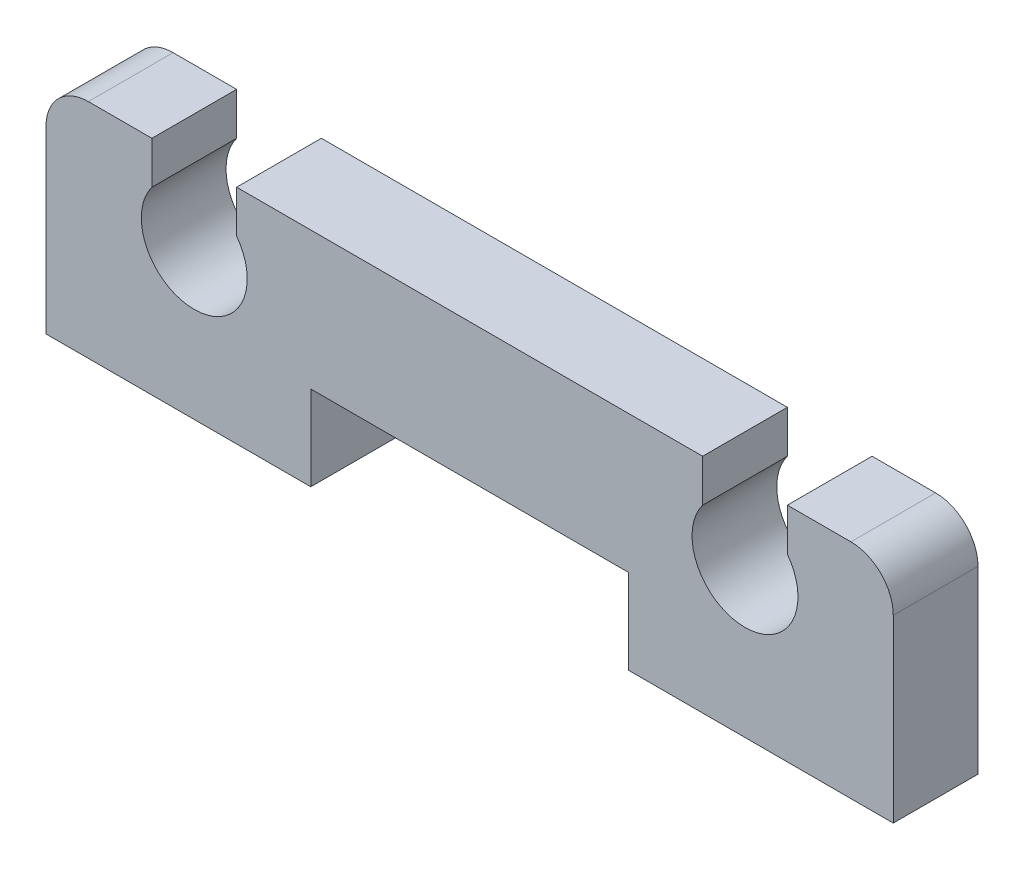
ISO-10303-21;
HEADER;
FILE_DESCRIPTION(('STEP AP214'),'2;1');
FILE_NAME('part.step','',(''),(''),'','','');
FILE_SCHEMA(('AUTOMOTIVE_DESIGN { 1 0 10303 214 1 1 1 1 }'));
ENDSEC;
DATA;
#1=APPLICATION_CONTEXT('core data for automotive mechanical design processes');
#2=APPLICATION_PROTOCOL_DEFINITION('international standard','automotive_design',2000,#1);
#3=PRODUCT_CONTEXT('',#1,'mechanical');
#4=PRODUCT('Part','Part','',(#3));
#5=PRODUCT_RELATED_PRODUCT_CATEGORY('part','',(#4));
#6=PRODUCT_DEFINITION_FORMATION('','',#4);
#7=PRODUCT_DEFINITION_CONTEXT('part definition',#1,'design');
#8=PRODUCT_DEFINITION('design','',#6,#7);
#9=PRODUCT_DEFINITION_SHAPE('','',#8);
#10=(LENGTH_UNIT() NAMED_UNIT(*) SI_UNIT(.MILLI.,.METRE.));
#11=(NAMED_UNIT(*) PLANE_ANGLE_UNIT() SI_UNIT($,.RADIAN.));
#12=(NAMED_UNIT(*) SI_UNIT($,.STERADIAN.) SOLID_ANGLE_UNIT());
#13=UNCERTAINTY_MEASURE_WITH_UNIT(LENGTH_MEASURE(1.E-05),#10,'distance_accuracy_value','');
#14=(GEOMETRIC_REPRESENTATION_CONTEXT(3) GLOBAL_UNCERTAINTY_ASSIGNED_CONTEXT((#13)) GLOBAL_UNIT_ASSIGNED_CONTEXT((#10,
#11,#12)) REPRESENTATION_CONTEXT('',''));
#15=CARTESIAN_POINT('',(0.,0.,0.));
#16=DIRECTION('',(0.,0.,1.));
#17=DIRECTION('',(1.,0.,0.));
#18=AXIS2_PLACEMENT_3D('',#15,#16,#17);
#19=CARTESIAN_POINT('',(-10.,0.,2.));
#20=DIRECTION('',(0.,1.,0.));
#21=DIRECTION('',(0.,0.,1.));
#22=AXIS2_PLACEMENT_3D('',#19,#20,#21);
#23=PLANE('',#22);
#24=DIRECTION('',(1.,0.,0.));
#25=VECTOR('',#24,1.);
#26=CARTESIAN_POINT('',(-10.,0.,0.));
#27=LINE('',#26,#25);
#28=CARTESIAN_POINT('',(-10.,0.,0.));
#29=VERTEX_POINT('',#28);
#30=CARTESIAN_POINT('',(-3.75,0.,0.));
#31=VERTEX_POINT('',#30);
#32=EDGE_CURVE('E180',#29,#31,#27,.T.);
#33=ORIENTED_EDGE('',*,*,#32,.T.);
#34=DIRECTION('',(0.,0.,-1.));
#35=VECTOR('',#34,1.);
#36=CARTESIAN_POINT('',(-3.75,0.,2.));
#37=LINE('',#36,#35);
#38=CARTESIAN_POINT('',(-3.75,0.,2.));
#39=VERTEX_POINT('',#38);
#40=EDGE_CURVE('E162',#39,#31,#37,.T.);
#41=ORIENTED_EDGE('',*,*,#40,.F.);
#42=DIRECTION('',(1.,0.,0.));
#43=VECTOR('',#42,1.);
#44=CARTESIAN_POINT('',(-10.,0.,2.));
#45=LINE('',#44,#43);
#46=CARTESIAN_POINT('',(-10.,0.,2.));
#47=VERTEX_POINT('',#46);
#48=EDGE_CURVE('E168',#47,#39,#45,.T.);
#49=ORIENTED_EDGE('',*,*,#48,.F.);
#50=DIRECTION('',(0.,0.,-1.));
#51=VECTOR('',#50,1.);
#52=CARTESIAN_POINT('',(-10.,0.,2.));
#53=LINE('',#52,#51);
#54=EDGE_CURVE('E213',#47,#29,#53,.T.);
#55=ORIENTED_EDGE('',*,*,#54,.T.);
#56=EDGE_LOOP('',(#33,#41,#49,#55));
#57=FACE_BOUND('',#56,.T.);
#58=ADVANCED_FACE('F33',(#57),#23,.F.);
#59=CARTESIAN_POINT('',(-3.75,0.,2.));
#60=DIRECTION('',(-1.,0.,0.));
#61=DIRECTION('',(0.,0.,1.));
#62=AXIS2_PLACEMENT_3D('',#59,#60,#61);
#63=PLANE('',#62);
#64=DIRECTION('',(0.,1.,0.));
#65=VECTOR('',#64,1.);
#66=CARTESIAN_POINT('',(-3.75,0.,0.));
#67=LINE('',#66,#65);
#68=CARTESIAN_POINT('',(-3.75,2.,0.));
#69=VERTEX_POINT('',#68);
#70=EDGE_CURVE('E262',#31,#69,#67,.T.);
#71=ORIENTED_EDGE('',*,*,#70,.T.);
#72=DIRECTION('',(0.,0.,-1.));
#73=VECTOR('',#72,1.);
#74=CARTESIAN_POINT('',(-3.75,2.,2.));
#75=LINE('',#74,#73);
#76=CARTESIAN_POINT('',(-3.75,2.,2.));
#77=VERTEX_POINT('',#76);
#78=EDGE_CURVE('E165',#77,#69,#75,.T.);
#79=ORIENTED_EDGE('',*,*,#78,.F.);
#80=DIRECTION('',(0.,1.,0.));
#81=VECTOR('',#80,1.);
#82=CARTESIAN_POINT('',(-3.75,0.,2.));
#83=LINE('',#82,#81);
#84=EDGE_CURVE('E158',#39,#77,#83,.T.);
#85=ORIENTED_EDGE('',*,*,#84,.F.);
#86=ORIENTED_EDGE('',*,*,#40,.T.);
#87=EDGE_LOOP('',(#71,#79,#85,#86));
#88=FACE_BOUND('',#87,.T.);
#89=ADVANCED_FACE('F160',(#88),#63,.F.);
#90=CARTESIAN_POINT('',(-3.75,2.,2.));
#91=DIRECTION('',(0.,1.,0.));
#92=DIRECTION('',(-1.,0.,0.));
#93=AXIS2_PLACEMENT_3D('',#90,#91,#92);
#94=PLANE('',#93);
#95=DIRECTION('',(1.,0.,0.));
#96=VECTOR('',#95,1.);
#97=CARTESIAN_POINT('',(-3.75,2.,0.));
#98=LINE('',#97,#96);
#99=CARTESIAN_POINT('',(3.75,2.,0.));
#100=VERTEX_POINT('',#99);
#101=EDGE_CURVE('E256',#69,#100,#98,.T.);
#102=ORIENTED_EDGE('',*,*,#101,.T.);
#103=DIRECTION('',(0.,0.,-1.));
#104=VECTOR('',#103,1.);
#105=CARTESIAN_POINT('',(3.75,2.,2.));
#106=LINE('',#105,#104);
#107=CARTESIAN_POINT('',(3.75,2.,2.));
#108=VERTEX_POINT('',#107);
#109=EDGE_CURVE('E186',#108,#100,#106,.T.);
#110=ORIENTED_EDGE('',*,*,#109,.F.);
#111=DIRECTION('',(1.,0.,0.));
#112=VECTOR('',#111,1.);
#113=CARTESIAN_POINT('',(-3.75,2.,2.));
#114=LINE('',#113,#112);
#115=EDGE_CURVE('E167',#77,#108,#114,.T.);
#116=ORIENTED_EDGE('',*,*,#115,.F.);
#117=ORIENTED_EDGE('',*,*,#78,.T.);
#118=EDGE_LOOP('',(#102,#110,#116,#117));
#119=FACE_BOUND('',#118,.T.);
#120=ADVANCED_FACE('F297',(#119),#94,.F.);
#121=CARTESIAN_POINT('',(3.75,0.,2.));
#122=DIRECTION('',(1.,0.,0.));
#123=DIRECTION('',(0.,1.,0.));
#124=AXIS2_PLACEMENT_3D('',#121,#122,#123);
#125=PLANE('',#124);
#126=DIRECTION('',(0.,-1.,0.));
#127=VECTOR('',#126,1.);
#128=CARTESIAN_POINT('',(3.75,0.,0.));
#129=LINE('',#128,#127);
#130=CARTESIAN_POINT('',(3.75,0.,0.));
#131=VERTEX_POINT('',#130);
#132=EDGE_CURVE('E251',#100,#131,#129,.T.);
#133=ORIENTED_EDGE('',*,*,#132,.T.);
#134=DIRECTION('',(0.,0.,-1.));
#135=VECTOR('',#134,1.);
#136=CARTESIAN_POINT('',(3.75,0.,2.));
#137=LINE('',#136,#135);
#138=CARTESIAN_POINT('',(3.75,0.,2.));
#139=VERTEX_POINT('',#138);
#140=EDGE_CURVE('E242',#139,#131,#137,.T.);
#141=ORIENTED_EDGE('',*,*,#140,.F.);
#142=DIRECTION('',(0.,-1.,0.));
#143=VECTOR('',#142,1.);
#144=CARTESIAN_POINT('',(3.75,0.,2.));
#145=LINE('',#144,#143);
#146=EDGE_CURVE('E252',#108,#139,#145,.T.);
#147=ORIENTED_EDGE('',*,*,#146,.F.);
#148=ORIENTED_EDGE('',*,*,#109,.T.);
#149=EDGE_LOOP('',(#133,#141,#147,#148));
#150=FACE_BOUND('',#149,.T.);
#151=ADVANCED_FACE('F249',(#150),#125,.F.);
#152=CARTESIAN_POINT('',(10.,0.,2.));
#153=DIRECTION('',(0.,1.,0.));
#154=DIRECTION('',(-1.,0.,0.));
#155=AXIS2_PLACEMENT_3D('',#152,#153,#154);
#156=PLANE('',#155);
#157=DIRECTION('',(1.,0.,0.));
#158=VECTOR('',#157,1.);
#159=CARTESIAN_POINT('',(10.,0.,0.));
#160=LINE('',#159,#158);
#161=CARTESIAN_POINT('',(10.,0.,0.));
#162=VERTEX_POINT('',#161);
#163=EDGE_CURVE('E258',#131,#162,#160,.T.);
#164=ORIENTED_EDGE('',*,*,#163,.T.);
#165=DIRECTION('',(0.,0.,-1.));
#166=VECTOR('',#165,1.);
#167=CARTESIAN_POINT('',(10.,0.,2.));
#168=LINE('',#167,#166);
#169=CARTESIAN_POINT('',(10.,0.,2.));
#170=VERTEX_POINT('',#169);
#171=EDGE_CURVE('E239',#170,#162,#168,.T.);
#172=ORIENTED_EDGE('',*,*,#171,.F.);
#173=DIRECTION('',(1.,0.,0.));
#174=VECTOR('',#173,1.);
#175=CARTESIAN_POINT('',(10.,0.,2.));
#176=LINE('',#175,#174);
#177=EDGE_CURVE('E299',#139,#170,#176,.T.);
#178=ORIENTED_EDGE('',*,*,#177,.F.);
#179=ORIENTED_EDGE('',*,*,#140,.T.);
#180=EDGE_LOOP('',(#164,#172,#178,#179));
#181=FACE_BOUND('',#180,.T.);
#182=ADVANCED_FACE('F359',(#181),#156,.F.);
#183=CARTESIAN_POINT('',(10.,0.,2.));
#184=DIRECTION('',(-1.,0.,0.));
#185=DIRECTION('',(0.,0.,1.));
#186=AXIS2_PLACEMENT_3D('',#183,#184,#185);
#187=PLANE('',#186);
#188=DIRECTION('',(0.,1.,0.));
#189=VECTOR('',#188,1.);
#190=CARTESIAN_POINT('',(10.,0.,0.));
#191=LINE('',#190,#189);
#192=CARTESIAN_POINT('',(10.,4.25,0.));
#193=VERTEX_POINT('',#192);
#194=EDGE_CURVE('E260',#162,#193,#191,.T.);
#195=ORIENTED_EDGE('',*,*,#194,.T.);
#196=DIRECTION('',(0.,0.,-1.));
#197=VECTOR('',#196,1.);
#198=CARTESIAN_POINT('',(10.,4.25,2.));
#199=LINE('',#198,#197);
#200=CARTESIAN_POINT('',(10.,4.25,2.));
#201=VERTEX_POINT('',#200);
#202=EDGE_CURVE('E193',#193,#201,#199,.F.);
#203=ORIENTED_EDGE('',*,*,#202,.T.);
#204=DIRECTION('',(0.,1.,0.));
#205=VECTOR('',#204,1.);
#206=CARTESIAN_POINT('',(10.,0.,2.));
#207=LINE('',#206,#205);
#208=EDGE_CURVE('E303',#170,#201,#207,.T.);
#209=ORIENTED_EDGE('',*,*,#208,.F.);
#210=ORIENTED_EDGE('',*,*,#171,.T.);
#211=EDGE_LOOP('',(#195,#203,#209,#210));
#212=FACE_BOUND('',#211,.T.);
#213=ADVANCED_FACE('F352',(#212),#187,.F.);
#214=CARTESIAN_POINT('',(10.,5.25,2.));
#215=DIRECTION('',(0.,-1.,0.));
#216=DIRECTION('',(1.,0.,0.));
#217=AXIS2_PLACEMENT_3D('',#214,#215,#216);
#218=PLANE('',#217);
#219=DIRECTION('',(-1.,0.,0.));
#220=VECTOR('',#219,1.);
#221=CARTESIAN_POINT('',(10.,5.25,2.));
#222=LINE('',#221,#220);
#223=CARTESIAN_POINT('',(9.,5.25,2.));
#224=VERTEX_POINT('',#223);
#225=CARTESIAN_POINT('',(7.5,5.25,2.));
#226=VERTEX_POINT('',#225);
#227=EDGE_CURVE('E305',#224,#226,#222,.T.);
#228=ORIENTED_EDGE('',*,*,#227,.F.);
#229=DIRECTION('',(0.,0.,-1.));
#230=VECTOR('',#229,1.);
#231=CARTESIAN_POINT('',(9.,5.25,2.));
#232=LINE('',#231,#230);
#233=CARTESIAN_POINT('',(9.,5.25,0.));
#234=VERTEX_POINT('',#233);
#235=EDGE_CURVE('E181',#224,#234,#232,.T.);
#236=ORIENTED_EDGE('',*,*,#235,.T.);
#237=DIRECTION('',(-1.,0.,0.));
#238=VECTOR('',#237,1.);
#239=CARTESIAN_POINT('',(10.,5.25,0.));
#240=LINE('',#239,#238);
#241=CARTESIAN_POINT('',(7.5,5.25,0.));
#242=VERTEX_POINT('',#241);
#243=EDGE_CURVE('E268',#234,#242,#240,.T.);
#244=ORIENTED_EDGE('',*,*,#243,.T.);
#245=DIRECTION('',(0.,0.,-1.));
#246=VECTOR('',#245,1.);
#247=CARTESIAN_POINT('',(7.5,5.25,2.));
#248=LINE('',#247,#246);
#249=EDGE_CURVE('E236',#226,#242,#248,.T.);
#250=ORIENTED_EDGE('',*,*,#249,.F.);
#251=EDGE_LOOP('',(#228,#236,#244,#250));
#252=FACE_BOUND('',#251,.T.);
#253=ADVANCED_FACE('F347',(#252),#218,.F.);
#254=CARTESIAN_POINT('',(7.5,4.25,2.));
#255=DIRECTION('',(1.,0.,0.));
#256=DIRECTION('',(0.,1.,0.));
#257=AXIS2_PLACEMENT_3D('',#254,#255,#256);
#258=PLANE('',#257);
#259=DIRECTION('',(0.,-1.,0.));
#260=VECTOR('',#259,1.);
#261=CARTESIAN_POINT('',(7.5,4.25,0.));
#262=LINE('',#261,#260);
#263=CARTESIAN_POINT('',(7.5,4.25,0.));
#264=VERTEX_POINT('',#263);
#265=EDGE_CURVE('E270',#242,#264,#262,.T.);
#266=ORIENTED_EDGE('',*,*,#265,.T.);
#267=DIRECTION('',(0.,0.,-1.));
#268=VECTOR('',#267,1.);
#269=CARTESIAN_POINT('',(7.5,4.25,2.));
#270=LINE('',#269,#268);
#271=CARTESIAN_POINT('',(7.5,4.25,2.));
#272=VERTEX_POINT('',#271);
#273=EDGE_CURVE('E233',#272,#264,#270,.T.);
#274=ORIENTED_EDGE('',*,*,#273,.F.);
#275=DIRECTION('',(0.,-1.,0.));
#276=VECTOR('',#275,1.);
#277=CARTESIAN_POINT('',(7.5,4.25,2.));
#278=LINE('',#277,#276);
#279=EDGE_CURVE('E307',#226,#272,#278,.T.);
#280=ORIENTED_EDGE('',*,*,#279,.F.);
#281=ORIENTED_EDGE('',*,*,#249,.T.);
#282=EDGE_LOOP('',(#266,#274,#280,#281));
#283=FACE_BOUND('',#282,.T.);
#284=ADVANCED_FACE('F343',(#283),#258,.F.);
#285=CARTESIAN_POINT('',(6.5,3.5,2.));
#286=DIRECTION('',(0.,0.,-1.));
#287=DIRECTION('',(-1.,0.,0.));
#288=AXIS2_PLACEMENT_3D('',#285,#286,#287);
#289=CYLINDRICAL_SURFACE('',#288,1.25);
#290=CARTESIAN_POINT('',(6.5,3.5,0.));
#291=DIRECTION('',(0.,0.,-1.));
#292=DIRECTION('',(-1.,0.,0.));
#293=AXIS2_PLACEMENT_3D('',#290,#291,#292);
#294=CIRCLE('',#293,1.25);
#295=CARTESIAN_POINT('',(5.5,4.25,0.));
#296=VERTEX_POINT('',#295);
#297=EDGE_CURVE('E272',#264,#296,#294,.T.);
#298=ORIENTED_EDGE('',*,*,#297,.T.);
#299=DIRECTION('',(0.,0.,-1.));
#300=VECTOR('',#299,1.);
#301=CARTESIAN_POINT('',(5.5,4.25,2.));
#302=LINE('',#301,#300);
#303=CARTESIAN_POINT('',(5.5,4.25,2.));
#304=VERTEX_POINT('',#303);
#305=EDGE_CURVE('E230',#304,#296,#302,.T.);
#306=ORIENTED_EDGE('',*,*,#305,.F.);
#307=CARTESIAN_POINT('',(6.5,3.5,2.));
#308=DIRECTION('',(0.,0.,-1.));
#309=DIRECTION('',(-1.,0.,0.));
#310=AXIS2_PLACEMENT_3D('',#307,#308,#309);
#311=CIRCLE('',#310,1.25);
#312=EDGE_CURVE('E309',#272,#304,#311,.T.);
#313=ORIENTED_EDGE('',*,*,#312,.F.);
#314=ORIENTED_EDGE('',*,*,#273,.T.);
#315=EDGE_LOOP('',(#298,#306,#313,#314));
#316=FACE_BOUND('',#315,.T.);
#317=ADVANCED_FACE('F338',(#316),#289,.F.);
#318=CARTESIAN_POINT('',(5.5,4.25,2.));
#319=DIRECTION('',(-1.,0.,0.));
#320=DIRECTION('',(0.,-1.,0.));
#321=AXIS2_PLACEMENT_3D('',#318,#319,#320);
#322=PLANE('',#321);
#323=DIRECTION('',(0.,1.,0.));
#324=VECTOR('',#323,1.);
#325=CARTESIAN_POINT('',(5.5,4.25,0.));
#326=LINE('',#325,#324);
#327=CARTESIAN_POINT('',(5.5,5.25,0.));
#328=VERTEX_POINT('',#327);
#329=EDGE_CURVE('E274',#296,#328,#326,.T.);
#330=ORIENTED_EDGE('',*,*,#329,.T.);
#331=DIRECTION('',(0.,0.,-1.));
#332=VECTOR('',#331,1.);
#333=CARTESIAN_POINT('',(5.5,5.25,2.));
#334=LINE('',#333,#332);
#335=CARTESIAN_POINT('',(5.5,5.25,2.));
#336=VERTEX_POINT('',#335);
#337=EDGE_CURVE('E227',#336,#328,#334,.T.);
#338=ORIENTED_EDGE('',*,*,#337,.F.);
#339=DIRECTION('',(0.,1.,0.));
#340=VECTOR('',#339,1.);
#341=CARTESIAN_POINT('',(5.5,4.25,2.));
#342=LINE('',#341,#340);
#343=EDGE_CURVE('E311',#304,#336,#342,.T.);
#344=ORIENTED_EDGE('',*,*,#343,.F.);
#345=ORIENTED_EDGE('',*,*,#305,.T.);
#346=EDGE_LOOP('',(#330,#338,#344,#345));
#347=FACE_BOUND('',#346,.T.);
#348=ADVANCED_FACE('F333',(#347),#322,.F.);
#349=CARTESIAN_POINT('',(-5.5,5.25,2.));
#350=DIRECTION('',(0.,-1.,0.));
#351=DIRECTION('',(1.,0.,0.));
#352=AXIS2_PLACEMENT_3D('',#349,#350,#351);
#353=PLANE('',#352);
#354=DIRECTION('',(-1.,0.,0.));
#355=VECTOR('',#354,1.);
#356=CARTESIAN_POINT('',(-5.5,5.25,0.));
#357=LINE('',#356,#355);
#358=CARTESIAN_POINT('',(-5.5,5.25,0.));
#359=VERTEX_POINT('',#358);
#360=EDGE_CURVE('E276',#328,#359,#357,.T.);
#361=ORIENTED_EDGE('',*,*,#360,.T.);
#362=DIRECTION('',(0.,0.,-1.));
#363=VECTOR('',#362,1.);
#364=CARTESIAN_POINT('',(-5.5,5.25,2.));
#365=LINE('',#364,#363);
#366=CARTESIAN_POINT('',(-5.5,5.25,2.));
#367=VERTEX_POINT('',#366);
#368=EDGE_CURVE('E224',#367,#359,#365,.T.);
#369=ORIENTED_EDGE('',*,*,#368,.F.);
#370=DIRECTION('',(-1.,0.,0.));
#371=VECTOR('',#370,1.);
#372=CARTESIAN_POINT('',(-5.5,5.25,2.));
#373=LINE('',#372,#371);
#374=EDGE_CURVE('E313',#336,#367,#373,.T.);
#375=ORIENTED_EDGE('',*,*,#374,.F.);
#376=ORIENTED_EDGE('',*,*,#337,.T.);
#377=EDGE_LOOP('',(#361,#369,#375,#376));
#378=FACE_BOUND('',#377,.T.);
#379=ADVANCED_FACE('F329',(#378),#353,.F.);
#380=CARTESIAN_POINT('',(-5.5,4.25,2.));
#381=DIRECTION('',(1.,0.,0.));
#382=DIRECTION('',(0.,1.,0.));
#383=AXIS2_PLACEMENT_3D('',#380,#381,#382);
#384=PLANE('',#383);
#385=DIRECTION('',(0.,-1.,0.));
#386=VECTOR('',#385,1.);
#387=CARTESIAN_POINT('',(-5.5,4.25,0.));
#388=LINE('',#387,#386);
#389=CARTESIAN_POINT('',(-5.5,4.25,0.));
#390=VERTEX_POINT('',#389);
#391=EDGE_CURVE('E278',#359,#390,#388,.T.);
#392=ORIENTED_EDGE('',*,*,#391,.T.);
#393=DIRECTION('',(0.,0.,-1.));
#394=VECTOR('',#393,1.);
#395=CARTESIAN_POINT('',(-5.5,4.25,2.));
#396=LINE('',#395,#394);
#397=CARTESIAN_POINT('',(-5.5,4.25,2.));
#398=VERTEX_POINT('',#397);
#399=EDGE_CURVE('E221',#398,#390,#396,.T.);
#400=ORIENTED_EDGE('',*,*,#399,.F.);
#401=DIRECTION('',(0.,-1.,0.));
#402=VECTOR('',#401,1.);
#403=CARTESIAN_POINT('',(-5.5,4.25,2.));
#404=LINE('',#403,#402);
#405=EDGE_CURVE('E315',#367,#398,#404,.T.);
#406=ORIENTED_EDGE('',*,*,#405,.F.);
#407=ORIENTED_EDGE('',*,*,#368,.T.);
#408=EDGE_LOOP('',(#392,#400,#406,#407));
#409=FACE_BOUND('',#408,.T.);
#410=ADVANCED_FACE('F325',(#409),#384,.F.);
#411=CARTESIAN_POINT('',(-6.5,3.5,2.));
#412=DIRECTION('',(0.,0.,-1.));
#413=DIRECTION('',(-1.,0.,0.));
#414=AXIS2_PLACEMENT_3D('',#411,#412,#413);
#415=CYLINDRICAL_SURFACE('',#414,1.25);
#416=CARTESIAN_POINT('',(-6.5,3.5,0.));
#417=DIRECTION('',(0.,0.,-1.));
#418=DIRECTION('',(1.,0.,0.));
#419=AXIS2_PLACEMENT_3D('',#416,#417,#418);
#420=CIRCLE('',#419,1.25);
#421=CARTESIAN_POINT('',(-7.5,4.25,0.));
#422=VERTEX_POINT('',#421);
#423=EDGE_CURVE('E280',#390,#422,#420,.T.);
#424=ORIENTED_EDGE('',*,*,#423,.T.);
#425=DIRECTION('',(0.,0.,-1.));
#426=VECTOR('',#425,1.);
#427=CARTESIAN_POINT('',(-7.5,4.25,2.));
#428=LINE('',#427,#426);
#429=CARTESIAN_POINT('',(-7.5,4.25,2.));
#430=VERTEX_POINT('',#429);
#431=EDGE_CURVE('E218',#430,#422,#428,.T.);
#432=ORIENTED_EDGE('',*,*,#431,.F.);
#433=CARTESIAN_POINT('',(-6.5,3.5,2.));
#434=DIRECTION('',(0.,0.,-1.));
#435=DIRECTION('',(1.,0.,0.));
#436=AXIS2_PLACEMENT_3D('',#433,#434,#435);
#437=CIRCLE('',#436,1.25);
#438=EDGE_CURVE('E293',#398,#430,#437,.T.);
#439=ORIENTED_EDGE('',*,*,#438,.F.);
#440=ORIENTED_EDGE('',*,*,#399,.T.);
#441=EDGE_LOOP('',(#424,#432,#439,#440));
#442=FACE_BOUND('',#441,.T.);
#443=ADVANCED_FACE('F320',(#442),#415,.F.);
#444=CARTESIAN_POINT('',(-7.5,4.25,2.));
#445=DIRECTION('',(-1.,0.,0.));
#446=DIRECTION('',(0.,-1.,0.));
#447=AXIS2_PLACEMENT_3D('',#444,#445,#446);
#448=PLANE('',#447);
#449=DIRECTION('',(0.,1.,0.));
#450=VECTOR('',#449,1.);
#451=CARTESIAN_POINT('',(-7.5,4.25,0.));
#452=LINE('',#451,#450);
#453=CARTESIAN_POINT('',(-7.5,5.25,0.));
#454=VERTEX_POINT('',#453);
#455=EDGE_CURVE('E209',#422,#454,#452,.T.);
#456=ORIENTED_EDGE('',*,*,#455,.T.);
#457=DIRECTION('',(0.,0.,-1.));
#458=VECTOR('',#457,1.);
#459=CARTESIAN_POINT('',(-7.5,5.25,2.));
#460=LINE('',#459,#458);
#461=CARTESIAN_POINT('',(-7.5,5.25,2.));
#462=VERTEX_POINT('',#461);
#463=EDGE_CURVE('E215',#462,#454,#460,.T.);
#464=ORIENTED_EDGE('',*,*,#463,.F.);
#465=DIRECTION('',(0.,1.,0.));
#466=VECTOR('',#465,1.);
#467=CARTESIAN_POINT('',(-7.5,4.25,2.));
#468=LINE('',#467,#466);
#469=EDGE_CURVE('E290',#430,#462,#468,.T.);
#470=ORIENTED_EDGE('',*,*,#469,.F.);
#471=ORIENTED_EDGE('',*,*,#431,.T.);
#472=EDGE_LOOP('',(#456,#464,#470,#471));
#473=FACE_BOUND('',#472,.T.);
#474=ADVANCED_FACE('F284',(#473),#448,.F.);
#475=CARTESIAN_POINT('',(-10.,5.25,2.));
#476=DIRECTION('',(0.,-1.,0.));
#477=DIRECTION('',(0.,0.,-1.));
#478=AXIS2_PLACEMENT_3D('',#475,#476,#477);
#479=PLANE('',#478);
#480=DIRECTION('',(-1.,0.,0.));
#481=VECTOR('',#480,1.);
#482=CARTESIAN_POINT('',(-10.,5.25,0.));
#483=LINE('',#482,#481);
#484=CARTESIAN_POINT('',(-9.,5.25,0.));
#485=VERTEX_POINT('',#484);
#486=EDGE_CURVE('E207',#454,#485,#483,.T.);
#487=ORIENTED_EDGE('',*,*,#486,.T.);
#488=DIRECTION('',(0.,0.,-1.));
#489=VECTOR('',#488,1.);
#490=CARTESIAN_POINT('',(-9.,5.25,2.));
#491=LINE('',#490,#489);
#492=CARTESIAN_POINT('',(-9.,5.25,2.));
#493=VERTEX_POINT('',#492);
#494=EDGE_CURVE('E11',#485,#493,#491,.F.);
#495=ORIENTED_EDGE('',*,*,#494,.T.);
#496=DIRECTION('',(-1.,0.,0.));
#497=VECTOR('',#496,1.);
#498=CARTESIAN_POINT('',(-10.,5.25,2.));
#499=LINE('',#498,#497);
#500=EDGE_CURVE('E289',#462,#493,#499,.T.);
#501=ORIENTED_EDGE('',*,*,#500,.F.);
#502=ORIENTED_EDGE('',*,*,#463,.T.);
#503=EDGE_LOOP('',(#487,#495,#501,#502));
#504=FACE_BOUND('',#503,.T.);
#505=ADVANCED_FACE('F288',(#504),#479,.F.);
#506=CARTESIAN_POINT('',(-10.,0.,2.));
#507=DIRECTION('',(1.,0.,0.));
#508=DIRECTION('',(0.,0.,-1.));
#509=AXIS2_PLACEMENT_3D('',#506,#507,#508);
#510=PLANE('',#509);
#511=DIRECTION('',(0.,-1.,0.));
#512=VECTOR('',#511,1.);
#513=CARTESIAN_POINT('',(-10.,0.,2.));
#514=LINE('',#513,#512);
#515=CARTESIAN_POINT('',(-10.,4.25,2.));
#516=VERTEX_POINT('',#515);
#517=EDGE_CURVE('E173',#516,#47,#514,.T.);
#518=ORIENTED_EDGE('',*,*,#517,.F.);
#519=DIRECTION('',(0.,0.,-1.));
#520=VECTOR('',#519,1.);
#521=CARTESIAN_POINT('',(-10.,4.25,2.));
#522=LINE('',#521,#520);
#523=CARTESIAN_POINT('',(-10.,4.25,0.));
#524=VERTEX_POINT('',#523);
#525=EDGE_CURVE('E41',#516,#524,#522,.T.);
#526=ORIENTED_EDGE('',*,*,#525,.T.);
#527=DIRECTION('',(0.,-1.,0.));
#528=VECTOR('',#527,1.);
#529=CARTESIAN_POINT('',(-10.,0.,0.));
#530=LINE('',#529,#528);
#531=EDGE_CURVE('E177',#524,#29,#530,.T.);
#532=ORIENTED_EDGE('',*,*,#531,.T.);
#533=ORIENTED_EDGE('',*,*,#54,.F.);
#534=EDGE_LOOP('',(#518,#526,#532,#533));
#535=FACE_BOUND('',#534,.T.);
#536=ADVANCED_FACE('F201',(#535),#510,.F.);
#537=CARTESIAN_POINT('',(6.5,3.5,2.));
#538=DIRECTION('',(0.,0.,-1.));
#539=DIRECTION('',(-1.,0.,0.));
#540=AXIS2_PLACEMENT_3D('',#537,#538,#539);
#541=PLANE('',#540);
#542=ORIENTED_EDGE('',*,*,#208,.T.);
#543=CARTESIAN_POINT('',(9.,4.25,2.));
#544=DIRECTION('',(0.,0.,-1.));
#545=DIRECTION('',(-1.,0.,0.));
#546=AXIS2_PLACEMENT_3D('',#543,#544,#545);
#547=CIRCLE('',#546,1.);
#548=EDGE_CURVE('E196',#201,#224,#547,.F.);
#549=ORIENTED_EDGE('',*,*,#548,.T.);
#550=ORIENTED_EDGE('',*,*,#227,.T.);
#551=ORIENTED_EDGE('',*,*,#279,.T.);
#552=ORIENTED_EDGE('',*,*,#312,.T.);
#553=ORIENTED_EDGE('',*,*,#343,.T.);
#554=ORIENTED_EDGE('',*,*,#374,.T.);
#555=ORIENTED_EDGE('',*,*,#405,.T.);
#556=ORIENTED_EDGE('',*,*,#438,.T.);
#557=ORIENTED_EDGE('',*,*,#469,.T.);
#558=ORIENTED_EDGE('',*,*,#500,.T.);
#559=CARTESIAN_POINT('',(-9.,4.25,2.));
#560=DIRECTION('',(0.,0.,-1.));
#561=DIRECTION('',(-1.,0.,0.));
#562=AXIS2_PLACEMENT_3D('',#559,#560,#561);
#563=CIRCLE('',#562,1.);
#564=EDGE_CURVE('E48',#493,#516,#563,.F.);
#565=ORIENTED_EDGE('',*,*,#564,.T.);
#566=ORIENTED_EDGE('',*,*,#517,.T.);
#567=ORIENTED_EDGE('',*,*,#48,.T.);
#568=ORIENTED_EDGE('',*,*,#84,.T.);
#569=ORIENTED_EDGE('',*,*,#115,.T.);
#570=ORIENTED_EDGE('',*,*,#146,.T.);
#571=ORIENTED_EDGE('',*,*,#177,.T.);
#572=EDGE_LOOP('',(#542,#549,#550,#551,#552,#553,#554,#555,#556,#557,#558,#565,#566,#567,#568,
#569,#570,#571));
#573=FACE_BOUND('',#572,.T.);
#574=ADVANCED_FACE('F172',(#573),#541,.F.);
#575=CARTESIAN_POINT('',(6.5,3.5,0.));
#576=DIRECTION('',(0.,0.,-1.));
#577=DIRECTION('',(-1.,0.,0.));
#578=AXIS2_PLACEMENT_3D('',#575,#576,#577);
#579=PLANE('',#578);
#580=ORIENTED_EDGE('',*,*,#243,.F.);
#581=CARTESIAN_POINT('',(9.,4.25,0.));
#582=DIRECTION('',(0.,0.,-1.));
#583=DIRECTION('',(-1.,0.,0.));
#584=AXIS2_PLACEMENT_3D('',#581,#582,#583);
#585=CIRCLE('',#584,1.);
#586=EDGE_CURVE('E191',#234,#193,#585,.T.);
#587=ORIENTED_EDGE('',*,*,#586,.T.);
#588=ORIENTED_EDGE('',*,*,#194,.F.);
#589=ORIENTED_EDGE('',*,*,#163,.F.);
#590=ORIENTED_EDGE('',*,*,#132,.F.);
#591=ORIENTED_EDGE('',*,*,#101,.F.);
#592=ORIENTED_EDGE('',*,*,#70,.F.);
#593=ORIENTED_EDGE('',*,*,#32,.F.);
#594=ORIENTED_EDGE('',*,*,#531,.F.);
#595=CARTESIAN_POINT('',(-9.,4.25,0.));
#596=DIRECTION('',(0.,0.,-1.));
#597=DIRECTION('',(-1.,0.,0.));
#598=AXIS2_PLACEMENT_3D('',#595,#596,#597);
#599=CIRCLE('',#598,1.);
#600=EDGE_CURVE('E184',#524,#485,#599,.T.);
#601=ORIENTED_EDGE('',*,*,#600,.T.);
#602=ORIENTED_EDGE('',*,*,#486,.F.);
#603=ORIENTED_EDGE('',*,*,#455,.F.);
#604=ORIENTED_EDGE('',*,*,#423,.F.);
#605=ORIENTED_EDGE('',*,*,#391,.F.);
#606=ORIENTED_EDGE('',*,*,#360,.F.);
#607=ORIENTED_EDGE('',*,*,#329,.F.);
#608=ORIENTED_EDGE('',*,*,#297,.F.);
#609=ORIENTED_EDGE('',*,*,#265,.F.);
#610=EDGE_LOOP('',(#580,#587,#588,#589,#590,#591,#592,#593,#594,#601,#602,#603,#604,#605,#606,
#607,#608,#609));
#611=FACE_BOUND('',#610,.T.);
#612=ADVANCED_FACE('F205',(#611),#579,.T.);
#613=CARTESIAN_POINT('',(9.,4.25,2.));
#614=DIRECTION('',(0.,0.,-1.));
#615=DIRECTION('',(-1.,0.,0.));
#616=AXIS2_PLACEMENT_3D('',#613,#614,#615);
#617=CYLINDRICAL_SURFACE('',#616,1.);
#618=ORIENTED_EDGE('',*,*,#548,.F.);
#619=ORIENTED_EDGE('',*,*,#202,.F.);
#620=ORIENTED_EDGE('',*,*,#586,.F.);
#621=ORIENTED_EDGE('',*,*,#235,.F.);
#622=EDGE_LOOP('',(#618,#619,#620,#621));
#623=FACE_BOUND('',#622,.T.);
#624=ADVANCED_FACE('F356',(#623),#617,.T.);
#625=CARTESIAN_POINT('',(-9.,4.25,2.));
#626=DIRECTION('',(0.,0.,-1.));
#627=DIRECTION('',(-1.,0.,0.));
#628=AXIS2_PLACEMENT_3D('',#625,#626,#627);
#629=CYLINDRICAL_SURFACE('',#628,1.);
#630=ORIENTED_EDGE('',*,*,#564,.F.);
#631=ORIENTED_EDGE('',*,*,#494,.F.);
#632=ORIENTED_EDGE('',*,*,#600,.F.);
#633=ORIENTED_EDGE('',*,*,#525,.F.);
#634=EDGE_LOOP('',(#630,#631,#632,#633));
#635=FACE_BOUND('',#634,.T.);
#636=ADVANCED_FACE('F35',(#635),#629,.T.);
#637=CLOSED_SHELL('',(#58,#89,#120,#151,#182,#213,#253,#284,#317,#348,#379,#410,#443,#474,#505,
#536,#574,#612,#624,#636));
#638=MANIFOLD_SOLID_BREP('B2',#637);
#639=ADVANCED_BREP_SHAPE_REPRESENTATION('',(#18,#638),#14);
#640=SHAPE_DEFINITION_REPRESENTATION(#9,#639);
ENDSEC;
END-ISO-10303-21;
